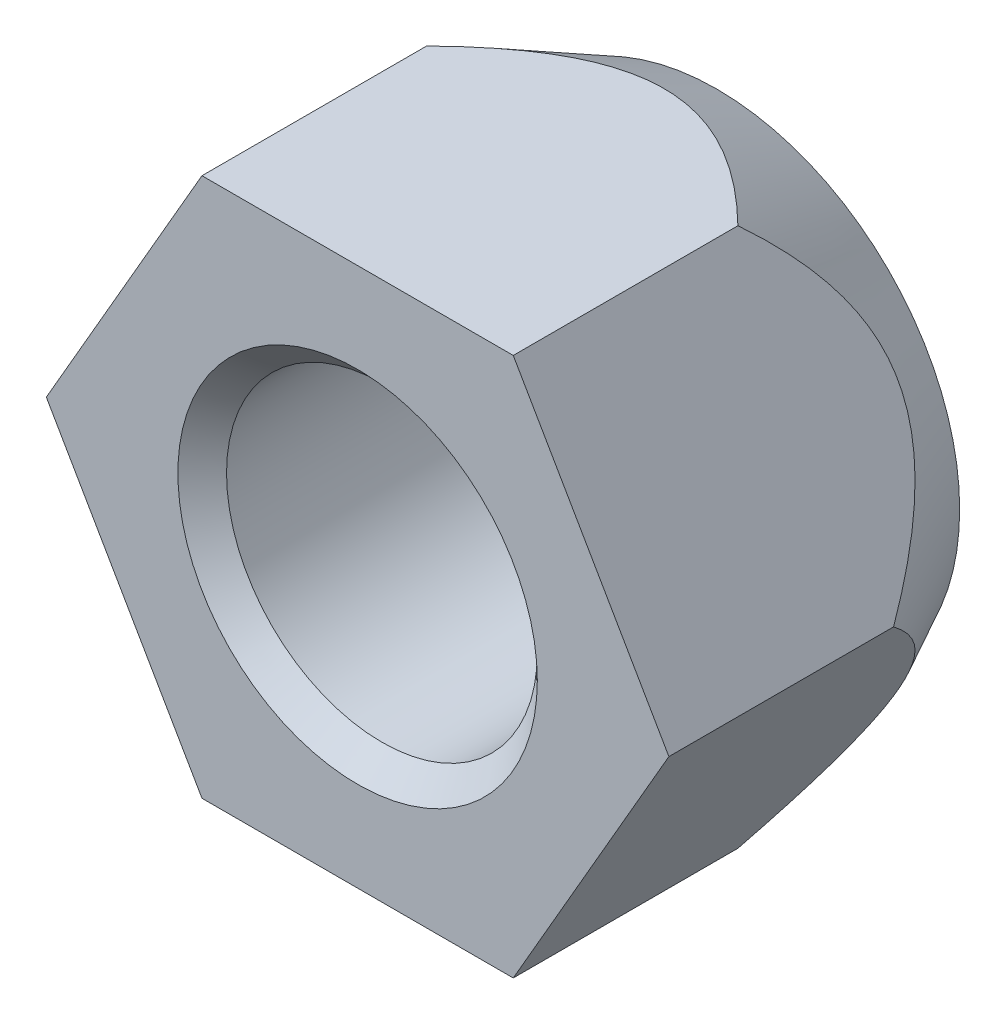
ISO-10303-21;
HEADER;
FILE_DESCRIPTION(('STEP AP214'),'2;1');
FILE_NAME('part.step','',(''),(''),'','','');
FILE_SCHEMA(('AUTOMOTIVE_DESIGN { 1 0 10303 214 1 1 1 1 }'));
ENDSEC;
DATA;
#1=APPLICATION_CONTEXT('core data for automotive mechanical design processes');
#2=APPLICATION_PROTOCOL_DEFINITION('international standard','automotive_design',2000,#1);
#3=PRODUCT_CONTEXT('',#1,'mechanical');
#4=PRODUCT('Part','Part','',(#3));
#5=PRODUCT_RELATED_PRODUCT_CATEGORY('part','',(#4));
#6=PRODUCT_DEFINITION_FORMATION('','',#4);
#7=PRODUCT_DEFINITION_CONTEXT('part definition',#1,'design');
#8=PRODUCT_DEFINITION('design','',#6,#7);
#9=PRODUCT_DEFINITION_SHAPE('','',#8);
#10=(LENGTH_UNIT() NAMED_UNIT(*) SI_UNIT(.MILLI.,.METRE.));
#11=(NAMED_UNIT(*) PLANE_ANGLE_UNIT() SI_UNIT($,.RADIAN.));
#12=(NAMED_UNIT(*) SI_UNIT($,.STERADIAN.) SOLID_ANGLE_UNIT());
#13=UNCERTAINTY_MEASURE_WITH_UNIT(LENGTH_MEASURE(1.E-05),#10,'distance_accuracy_value','');
#14=(GEOMETRIC_REPRESENTATION_CONTEXT(3) GLOBAL_UNCERTAINTY_ASSIGNED_CONTEXT((#13)) GLOBAL_UNIT_ASSIGNED_CONTEXT((#10,
#11,#12)) REPRESENTATION_CONTEXT('',''));
#15=CARTESIAN_POINT('',(0.,0.,0.));
#16=DIRECTION('',(0.,0.,1.));
#17=DIRECTION('',(1.,0.,0.));
#18=AXIS2_PLACEMENT_3D('',#15,#16,#17);
#19=CARTESIAN_POINT('',(0.,0.,0.));
#20=DIRECTION('',(0.,0.,-1.));
#21=DIRECTION('',(1.,0.,0.));
#22=AXIS2_PLACEMENT_3D('',#19,#20,#21);
#23=PLANE('',#22);
#24=DIRECTION('',(-0.5,-0.866025403784439,0.));
#25=VECTOR('',#24,1.);
#26=CARTESIAN_POINT('',(20.7846,0.,0.));
#27=LINE('',#26,#25);
#28=CARTESIAN_POINT('',(20.7846,0.,0.));
#29=VERTEX_POINT('',#28);
#30=CARTESIAN_POINT('',(10.3923,-17.9999916074981,0.));
#31=VERTEX_POINT('',#30);
#32=EDGE_CURVE('E10',#29,#31,#27,.T.);
#33=ORIENTED_EDGE('',*,*,#32,.F.);
#34=DIRECTION('',(0.5,-0.866025403784439,0.));
#35=VECTOR('',#34,1.);
#36=CARTESIAN_POINT('',(10.3923,17.9999916074981,0.));
#37=LINE('',#36,#35);
#38=CARTESIAN_POINT('',(10.3923,17.9999916074981,0.));
#39=VERTEX_POINT('',#38);
#40=EDGE_CURVE('E124',#39,#29,#37,.T.);
#41=ORIENTED_EDGE('',*,*,#40,.F.);
#42=DIRECTION('',(1.,0.,0.));
#43=VECTOR('',#42,1.);
#44=CARTESIAN_POINT('',(-10.3923,17.9999916074981,0.));
#45=LINE('',#44,#43);
#46=CARTESIAN_POINT('',(-10.3923,17.9999916074981,0.));
#47=VERTEX_POINT('',#46);
#48=EDGE_CURVE('E26',#47,#39,#45,.T.);
#49=ORIENTED_EDGE('',*,*,#48,.F.);
#50=DIRECTION('',(0.5,0.866025403784439,0.));
#51=VECTOR('',#50,1.);
#52=CARTESIAN_POINT('',(-20.7846,0.,0.));
#53=LINE('',#52,#51);
#54=CARTESIAN_POINT('',(-20.7846,0.,0.));
#55=VERTEX_POINT('',#54);
#56=EDGE_CURVE('E123',#55,#47,#53,.T.);
#57=ORIENTED_EDGE('',*,*,#56,.F.);
#58=DIRECTION('',(-0.5,0.866025403784439,0.));
#59=VECTOR('',#58,1.);
#60=CARTESIAN_POINT('',(-10.3923,-17.9999916074981,0.));
#61=LINE('',#60,#59);
#62=CARTESIAN_POINT('',(-10.3923,-17.9999916074981,0.));
#63=VERTEX_POINT('',#62);
#64=EDGE_CURVE('E71',#63,#55,#61,.T.);
#65=ORIENTED_EDGE('',*,*,#64,.F.);
#66=DIRECTION('',(-1.,0.,0.));
#67=VECTOR('',#66,1.);
#68=CARTESIAN_POINT('',(10.3923,-17.9999916074981,0.));
#69=LINE('',#68,#67);
#70=EDGE_CURVE('E20',#31,#63,#69,.T.);
#71=ORIENTED_EDGE('',*,*,#70,.F.);
#72=EDGE_LOOP('',(#33,#41,#49,#57,#65,#71));
#73=FACE_BOUND('',#72,.T.);
#74=CARTESIAN_POINT('',(0.,0.,0.));
#75=DIRECTION('',(0.,0.,-1.));
#76=DIRECTION('',(1.,0.,0.));
#77=AXIS2_PLACEMENT_3D('',#74,#75,#76);
#78=CIRCLE('',#77,12.);
#79=CARTESIAN_POINT('',(12.,0.,0.));
#80=VERTEX_POINT('',#79);
#81=EDGE_CURVE('E111',#80,#80,#78,.T.);
#82=ORIENTED_EDGE('',*,*,#81,.T.);
#83=EDGE_LOOP('',(#82));
#84=FACE_BOUND('',#83,.T.);
#85=ADVANCED_FACE('F16',(#73,#84),#23,.F.);
#86=CARTESIAN_POINT('',(15.58845,-8.99999580374902,0.));
#87=DIRECTION('',(0.866025403784439,-0.5,0.));
#88=DIRECTION('',(-0.5,-0.866025403784439,0.));
#89=AXIS2_PLACEMENT_3D('',#86,#87,#88);
#90=PLANE('',#89);
#91=CARTESIAN_POINT('',(20.7846,0.,-15.));
#92=CARTESIAN_POINT('',(15.58845,-8.99999580374903,-25.2005300353357));
#93=CARTESIAN_POINT('',(10.3923,-17.9999916074981,-15.));
#94=(BOUNDED_CURVE() B_SPLINE_CURVE(2,(#91,#92,#93),.UNSPECIFIED.,.F.,
.F.) B_SPLINE_CURVE_WITH_KNOTS((3,3),(0.,23.4846288736221),
.UNSPECIFIED.) CURVE() GEOMETRIC_REPRESENTATION_ITEM() RATIONAL_B_SPLINE_CURVE((1.,
1.15470053837925,1.)) REPRESENTATION_ITEM(''));
#95=CARTESIAN_POINT('',(20.7846,0.,-15.));
#96=VERTEX_POINT('',#95);
#97=CARTESIAN_POINT('',(10.3923,-17.9999916074981,-15.));
#98=VERTEX_POINT('',#97);
#99=EDGE_CURVE('E144',#96,#98,#94,.T.);
#100=ORIENTED_EDGE('',*,*,#99,.F.);
#101=DIRECTION('',(0.,0.,-1.));
#102=VECTOR('',#101,1.);
#103=CARTESIAN_POINT('',(20.7846,0.,0.));
#104=LINE('',#103,#102);
#105=EDGE_CURVE('E59',#29,#96,#104,.T.);
#106=ORIENTED_EDGE('',*,*,#105,.F.);
#107=ORIENTED_EDGE('',*,*,#32,.T.);
#108=DIRECTION('',(0.,0.,-1.));
#109=VECTOR('',#108,1.);
#110=CARTESIAN_POINT('',(10.3923,-17.9999916074981,0.));
#111=LINE('',#110,#109);
#112=EDGE_CURVE('E93',#31,#98,#111,.T.);
#113=ORIENTED_EDGE('',*,*,#112,.T.);
#114=EDGE_LOOP('',(#100,#106,#107,#113));
#115=FACE_BOUND('',#114,.T.);
#116=ADVANCED_FACE('F91',(#115),#90,.T.);
#117=CARTESIAN_POINT('',(0.,17.9999916074981,0.));
#118=DIRECTION('',(0.,1.,0.));
#119=DIRECTION('',(1.,0.,0.));
#120=AXIS2_PLACEMENT_3D('',#117,#118,#119);
#121=PLANE('',#120);
#122=CARTESIAN_POINT('',(-10.3923,17.9999916074981,-15.));
#123=CARTESIAN_POINT('',(0.,17.999991607498,-25.2005300353357));
#124=CARTESIAN_POINT('',(10.3923,17.9999916074981,-15.));
#125=(BOUNDED_CURVE() B_SPLINE_CURVE(2,(#122,#123,#124),.UNSPECIFIED.,.F.,
.F.) B_SPLINE_CURVE_WITH_KNOTS((3,3),(0.,23.4846288736221),
.UNSPECIFIED.) CURVE() GEOMETRIC_REPRESENTATION_ITEM() RATIONAL_B_SPLINE_CURVE((1.,
1.15470053837925,1.)) REPRESENTATION_ITEM(''));
#126=CARTESIAN_POINT('',(-10.3923,17.9999916074981,-15.));
#127=VERTEX_POINT('',#126);
#128=CARTESIAN_POINT('',(10.3923,17.9999916074981,-15.));
#129=VERTEX_POINT('',#128);
#130=EDGE_CURVE('E143',#127,#129,#125,.T.);
#131=ORIENTED_EDGE('',*,*,#130,.F.);
#132=DIRECTION('',(0.,0.,-1.));
#133=VECTOR('',#132,1.);
#134=CARTESIAN_POINT('',(-10.3923,17.9999916074981,0.));
#135=LINE('',#134,#133);
#136=EDGE_CURVE('E130',#47,#127,#135,.T.);
#137=ORIENTED_EDGE('',*,*,#136,.F.);
#138=ORIENTED_EDGE('',*,*,#48,.T.);
#139=DIRECTION('',(0.,0.,-1.));
#140=VECTOR('',#139,1.);
#141=CARTESIAN_POINT('',(10.3923,17.9999916074981,0.));
#142=LINE('',#141,#140);
#143=EDGE_CURVE('E98',#39,#129,#142,.T.);
#144=ORIENTED_EDGE('',*,*,#143,.T.);
#145=EDGE_LOOP('',(#131,#137,#138,#144));
#146=FACE_BOUND('',#145,.T.);
#147=ADVANCED_FACE('F173',(#146),#121,.T.);
#148=CARTESIAN_POINT('',(15.58845,8.99999580374902,0.));
#149=DIRECTION('',(0.866025403784439,0.5,0.));
#150=DIRECTION('',(0.5,-0.866025403784439,0.));
#151=AXIS2_PLACEMENT_3D('',#148,#149,#150);
#152=PLANE('',#151);
#153=CARTESIAN_POINT('',(10.3923,17.9999916074981,-15.));
#154=CARTESIAN_POINT('',(15.58845,8.999995803749,-25.2005300353357));
#155=CARTESIAN_POINT('',(20.7846,0.,-15.));
#156=(BOUNDED_CURVE() B_SPLINE_CURVE(2,(#153,#154,#155),.UNSPECIFIED.,.F.,
.F.) B_SPLINE_CURVE_WITH_KNOTS((3,3),(0.,23.4846288736221),
.UNSPECIFIED.) CURVE() GEOMETRIC_REPRESENTATION_ITEM() RATIONAL_B_SPLINE_CURVE((1.,
1.15470053837925,1.)) REPRESENTATION_ITEM(''));
#157=EDGE_CURVE('E151',#129,#96,#156,.T.);
#158=ORIENTED_EDGE('',*,*,#157,.F.);
#159=ORIENTED_EDGE('',*,*,#143,.F.);
#160=ORIENTED_EDGE('',*,*,#40,.T.);
#161=ORIENTED_EDGE('',*,*,#105,.T.);
#162=EDGE_LOOP('',(#158,#159,#160,#161));
#163=FACE_BOUND('',#162,.T.);
#164=ADVANCED_FACE('F18',(#163),#152,.T.);
#165=CARTESIAN_POINT('',(0.,0.,-24.));
#166=DIRECTION('',(0.,0.,-1.));
#167=DIRECTION('',(1.,0.,0.));
#168=AXIS2_PLACEMENT_3D('',#165,#166,#167);
#169=PLANE('',#168);
#170=CARTESIAN_POINT('',(0.,0.,-24.));
#171=DIRECTION('',(0.,0.,1.));
#172=DIRECTION('',(1.,0.,0.));
#173=AXIS2_PLACEMENT_3D('',#170,#171,#172);
#174=CIRCLE('',#173,16.2);
#175=CARTESIAN_POINT('',(16.2,0.,-24.));
#176=VERTEX_POINT('',#175);
#177=EDGE_CURVE('E65',#176,#176,#174,.T.);
#178=ORIENTED_EDGE('',*,*,#177,.F.);
#179=EDGE_LOOP('',(#178));
#180=FACE_BOUND('',#179,.T.);
#181=CARTESIAN_POINT('',(0.,0.,-24.));
#182=DIRECTION('',(0.,0.,1.));
#183=DIRECTION('',(1.,0.,0.));
#184=AXIS2_PLACEMENT_3D('',#181,#182,#183);
#185=CIRCLE('',#184,12.);
#186=CARTESIAN_POINT('',(12.,0.,-24.));
#187=VERTEX_POINT('',#186);
#188=EDGE_CURVE('E110',#187,#187,#185,.T.);
#189=ORIENTED_EDGE('',*,*,#188,.T.);
#190=EDGE_LOOP('',(#189));
#191=FACE_BOUND('',#190,.T.);
#192=ADVANCED_FACE('F201',(#180,#191),#169,.T.);
#193=CARTESIAN_POINT('',(0.,-17.9999916074981,0.));
#194=DIRECTION('',(0.,-1.,0.));
#195=DIRECTION('',(-1.,0.,0.));
#196=AXIS2_PLACEMENT_3D('',#193,#194,#195);
#197=PLANE('',#196);
#198=CARTESIAN_POINT('',(10.3923,-17.9999916074981,-15.));
#199=CARTESIAN_POINT('',(0.,-17.9999916074981,-25.2005300353357));
#200=CARTESIAN_POINT('',(-10.3923,-17.9999916074981,-15.));
#201=(BOUNDED_CURVE() B_SPLINE_CURVE(2,(#198,#199,#200),.UNSPECIFIED.,.F.,
.F.) B_SPLINE_CURVE_WITH_KNOTS((3,3),(0.,23.4846288736221),
.UNSPECIFIED.) CURVE() GEOMETRIC_REPRESENTATION_ITEM() RATIONAL_B_SPLINE_CURVE((1.,
1.15470053837925,1.)) REPRESENTATION_ITEM(''));
#202=CARTESIAN_POINT('',(-10.3923,-17.9999916074981,-15.));
#203=VERTEX_POINT('',#202);
#204=EDGE_CURVE('E102',#98,#203,#201,.T.);
#205=ORIENTED_EDGE('',*,*,#204,.F.);
#206=ORIENTED_EDGE('',*,*,#112,.F.);
#207=ORIENTED_EDGE('',*,*,#70,.T.);
#208=DIRECTION('',(0.,0.,-1.));
#209=VECTOR('',#208,1.);
#210=CARTESIAN_POINT('',(-10.3923,-17.9999916074981,0.));
#211=LINE('',#210,#209);
#212=EDGE_CURVE('E104',#63,#203,#211,.T.);
#213=ORIENTED_EDGE('',*,*,#212,.T.);
#214=EDGE_LOOP('',(#205,#206,#207,#213));
#215=FACE_BOUND('',#214,.T.);
#216=ADVANCED_FACE('F100',(#215),#197,.T.);
#217=CARTESIAN_POINT('',(-15.58845,-8.99999580374903,0.));
#218=DIRECTION('',(-0.866025403784439,-0.5,0.));
#219=DIRECTION('',(-0.5,0.866025403784439,0.));
#220=AXIS2_PLACEMENT_3D('',#217,#218,#219);
#221=PLANE('',#220);
#222=CARTESIAN_POINT('',(-10.3923,-17.9999916074981,-15.));
#223=CARTESIAN_POINT('',(-15.58845,-8.999995803749,-25.2005300353357));
#224=CARTESIAN_POINT('',(-20.7846,0.,-15.));
#225=(BOUNDED_CURVE() B_SPLINE_CURVE(2,(#222,#223,#224),.UNSPECIFIED.,.F.,
.F.) B_SPLINE_CURVE_WITH_KNOTS((3,3),(0.,23.4846288736221),
.UNSPECIFIED.) CURVE() GEOMETRIC_REPRESENTATION_ITEM() RATIONAL_B_SPLINE_CURVE((1.,
1.15470053837925,1.)) REPRESENTATION_ITEM(''));
#226=CARTESIAN_POINT('',(-20.7846,0.,-15.));
#227=VERTEX_POINT('',#226);
#228=EDGE_CURVE('E116',#203,#227,#225,.T.);
#229=ORIENTED_EDGE('',*,*,#228,.F.);
#230=ORIENTED_EDGE('',*,*,#212,.F.);
#231=ORIENTED_EDGE('',*,*,#64,.T.);
#232=DIRECTION('',(0.,0.,-1.));
#233=VECTOR('',#232,1.);
#234=CARTESIAN_POINT('',(-20.7846,0.,0.));
#235=LINE('',#234,#233);
#236=EDGE_CURVE('E121',#55,#227,#235,.T.);
#237=ORIENTED_EDGE('',*,*,#236,.T.);
#238=EDGE_LOOP('',(#229,#230,#231,#237));
#239=FACE_BOUND('',#238,.T.);
#240=ADVANCED_FACE('F176',(#239),#221,.T.);
#241=CARTESIAN_POINT('',(-15.58845,8.99999580374902,0.));
#242=DIRECTION('',(-0.866025403784439,0.5,0.));
#243=DIRECTION('',(0.5,0.866025403784439,0.));
#244=AXIS2_PLACEMENT_3D('',#241,#242,#243);
#245=PLANE('',#244);
#246=CARTESIAN_POINT('',(-20.7846,0.,-15.));
#247=CARTESIAN_POINT('',(-15.58845,8.99999580374902,-25.2005300353357));
#248=CARTESIAN_POINT('',(-10.3923,17.9999916074981,-15.));
#249=(BOUNDED_CURVE() B_SPLINE_CURVE(2,(#246,#247,#248),.UNSPECIFIED.,.F.,
.F.) B_SPLINE_CURVE_WITH_KNOTS((3,3),(0.,23.4846288736221),
.UNSPECIFIED.) CURVE() GEOMETRIC_REPRESENTATION_ITEM() RATIONAL_B_SPLINE_CURVE((1.,
1.15470053837925,1.)) REPRESENTATION_ITEM(''));
#250=EDGE_CURVE('E135',#227,#127,#249,.T.);
#251=ORIENTED_EDGE('',*,*,#250,.F.);
#252=ORIENTED_EDGE('',*,*,#236,.F.);
#253=ORIENTED_EDGE('',*,*,#56,.T.);
#254=ORIENTED_EDGE('',*,*,#136,.T.);
#255=EDGE_LOOP('',(#251,#252,#253,#254));
#256=FACE_BOUND('',#255,.T.);
#257=ADVANCED_FACE('F175',(#256),#245,.T.);
#258=CARTESIAN_POINT('',(0.,0.,-19.5));
#259=DIRECTION('',(0.,0.,1.));
#260=DIRECTION('',(1.,0.,0.));
#261=AXIS2_PLACEMENT_3D('',#258,#259,#260);
#262=CONICAL_SURFACE('',#261,18.4923,0.471139299556054);
#263=ORIENTED_EDGE('',*,*,#177,.T.);
#264=EDGE_LOOP('',(#263));
#265=FACE_BOUND('',#264,.T.);
#266=ORIENTED_EDGE('',*,*,#204,.T.);
#267=ORIENTED_EDGE('',*,*,#228,.T.);
#268=ORIENTED_EDGE('',*,*,#250,.T.);
#269=ORIENTED_EDGE('',*,*,#130,.T.);
#270=ORIENTED_EDGE('',*,*,#157,.T.);
#271=ORIENTED_EDGE('',*,*,#99,.T.);
#272=EDGE_LOOP('',(#266,#267,#268,#269,#270,#271));
#273=FACE_BOUND('',#272,.T.);
#274=ADVANCED_FACE('F178',(#265,#273),#262,.T.);
#275=CARTESIAN_POINT('',(0.,0.,-23.188125));
#276=DIRECTION('',(0.,0.,-1.));
#277=DIRECTION('',(1.,0.,0.));
#278=AXIS2_PLACEMENT_3D('',#275,#276,#277);
#279=CONICAL_SURFACE('',#278,11.188125,0.785398163397448);
#280=CARTESIAN_POINT('',(0.,0.,-22.37625));
#281=DIRECTION('',(0.,0.,-1.));
#282=DIRECTION('',(1.,0.,0.));
#283=AXIS2_PLACEMENT_3D('',#280,#281,#282);
#284=CIRCLE('',#283,10.37625);
#285=CARTESIAN_POINT('',(10.37625,0.,-22.37625));
#286=VERTEX_POINT('',#285);
#287=EDGE_CURVE('E108',#286,#286,#284,.T.);
#288=ORIENTED_EDGE('',*,*,#287,.F.);
#289=EDGE_LOOP('',(#288));
#290=FACE_BOUND('',#289,.T.);
#291=ORIENTED_EDGE('',*,*,#188,.F.);
#292=EDGE_LOOP('',(#291));
#293=FACE_BOUND('',#292,.T.);
#294=ADVANCED_FACE('F192',(#290,#293),#279,.F.);
#295=CARTESIAN_POINT('',(0.,0.,-12.));
#296=DIRECTION('',(0.,0.,1.));
#297=DIRECTION('',(1.,0.,0.));
#298=AXIS2_PLACEMENT_3D('',#295,#296,#297);
#299=CYLINDRICAL_SURFACE('',#298,10.37625);
#300=CARTESIAN_POINT('',(0.,0.,-1.62375));
#301=DIRECTION('',(0.,0.,-1.));
#302=DIRECTION('',(1.,0.,0.));
#303=AXIS2_PLACEMENT_3D('',#300,#301,#302);
#304=CIRCLE('',#303,10.37625);
#305=CARTESIAN_POINT('',(10.37625,0.,-1.62375));
#306=VERTEX_POINT('',#305);
#307=EDGE_CURVE('E127',#306,#306,#304,.T.);
#308=ORIENTED_EDGE('',*,*,#307,.F.);
#309=EDGE_LOOP('',(#308));
#310=FACE_BOUND('',#309,.T.);
#311=ORIENTED_EDGE('',*,*,#287,.T.);
#312=EDGE_LOOP('',(#311));
#313=FACE_BOUND('',#312,.T.);
#314=ADVANCED_FACE('F189',(#310,#313),#299,.F.);
#315=CARTESIAN_POINT('',(0.,0.,-0.811875));
#316=DIRECTION('',(0.,0.,1.));
#317=DIRECTION('',(1.,0.,0.));
#318=AXIS2_PLACEMENT_3D('',#315,#316,#317);
#319=CONICAL_SURFACE('',#318,11.188125,0.785398163397448);
#320=ORIENTED_EDGE('',*,*,#81,.F.);
#321=EDGE_LOOP('',(#320));
#322=FACE_BOUND('',#321,.T.);
#323=ORIENTED_EDGE('',*,*,#307,.T.);
#324=EDGE_LOOP('',(#323));
#325=FACE_BOUND('',#324,.T.);
#326=ADVANCED_FACE('F187',(#322,#325),#319,.F.);
#327=CLOSED_SHELL('',(#85,#116,#147,#164,#192,#216,#240,#257,#274,#294,#314,#326));
#328=MANIFOLD_SOLID_BREP('B1',#327);
#329=ADVANCED_BREP_SHAPE_REPRESENTATION('',(#18,#328),#14);
#330=SHAPE_DEFINITION_REPRESENTATION(#9,#329);
ENDSEC;
END-ISO-10303-21;
